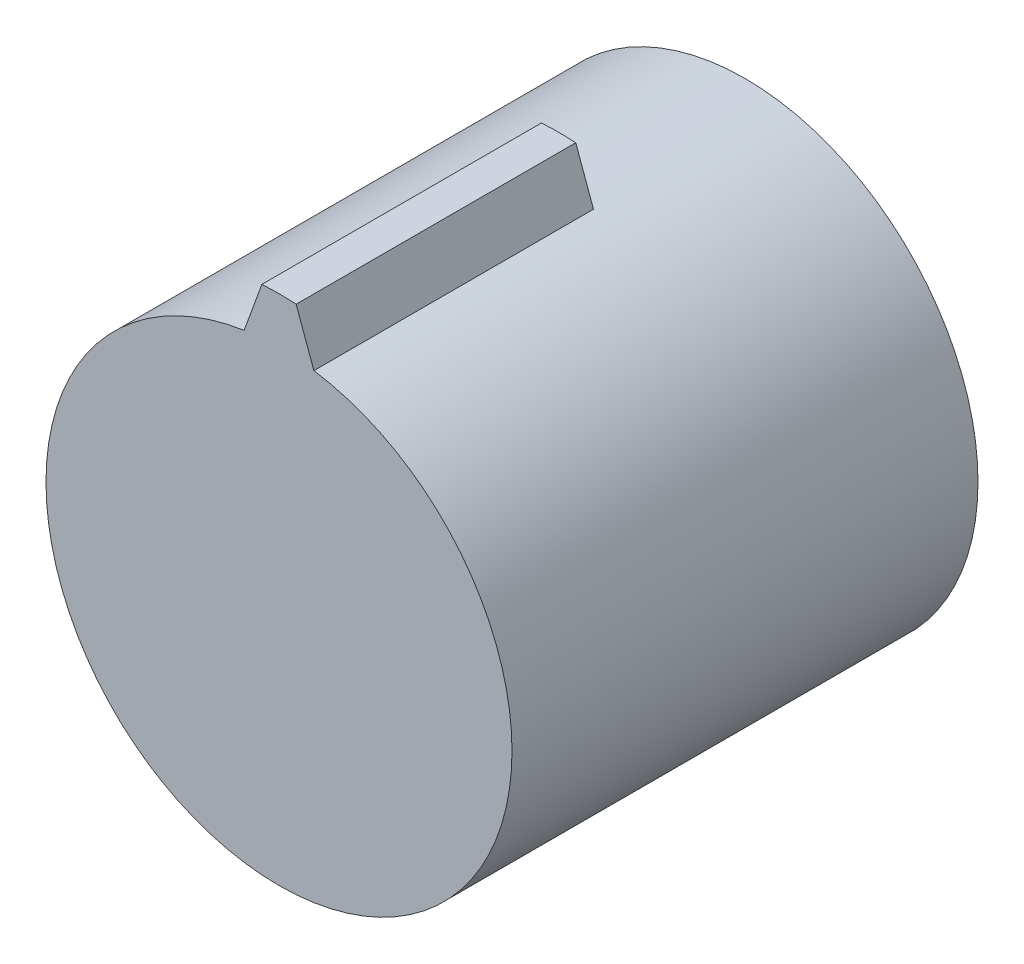
ISO-10303-21;
HEADER;
FILE_DESCRIPTION(('STEP AP214'),'2;1');
FILE_NAME('part.step','',(''),(''),'','','');
FILE_SCHEMA(('AUTOMOTIVE_DESIGN { 1 0 10303 214 1 1 1 1 }'));
ENDSEC;
DATA;
#1=APPLICATION_CONTEXT('core data for automotive mechanical design processes');
#2=APPLICATION_PROTOCOL_DEFINITION('international standard','automotive_design',2000,#1);
#3=PRODUCT_CONTEXT('',#1,'mechanical');
#4=PRODUCT('Part','Part','',(#3));
#5=PRODUCT_RELATED_PRODUCT_CATEGORY('part','',(#4));
#6=PRODUCT_DEFINITION_FORMATION('','',#4);
#7=PRODUCT_DEFINITION_CONTEXT('part definition',#1,'design');
#8=PRODUCT_DEFINITION('design','',#6,#7);
#9=PRODUCT_DEFINITION_SHAPE('','',#8);
#10=(LENGTH_UNIT() NAMED_UNIT(*) SI_UNIT(.MILLI.,.METRE.));
#11=(NAMED_UNIT(*) PLANE_ANGLE_UNIT() SI_UNIT($,.RADIAN.));
#12=(NAMED_UNIT(*) SI_UNIT($,.STERADIAN.) SOLID_ANGLE_UNIT());
#13=UNCERTAINTY_MEASURE_WITH_UNIT(LENGTH_MEASURE(1.E-05),#10,'distance_accuracy_value','');
#14=(GEOMETRIC_REPRESENTATION_CONTEXT(3) GLOBAL_UNCERTAINTY_ASSIGNED_CONTEXT((#13)) GLOBAL_UNIT_ASSIGNED_CONTEXT((#10,
#11,#12)) REPRESENTATION_CONTEXT('',''));
#15=CARTESIAN_POINT('',(0.,0.,0.));
#16=DIRECTION('',(0.,0.,1.));
#17=DIRECTION('',(1.,0.,0.));
#18=AXIS2_PLACEMENT_3D('',#15,#16,#17);
#19=CARTESIAN_POINT('',(0.,0.,5.));
#20=DIRECTION('',(0.,0.,-1.));
#21=DIRECTION('',(-1.,0.,0.));
#22=AXIS2_PLACEMENT_3D('',#19,#20,#21);
#23=CYLINDRICAL_SURFACE('',#22,2.5);
#24=CARTESIAN_POINT('',(0.,0.,5.));
#25=DIRECTION('',(0.,0.,1.));
#26=DIRECTION('',(1.,0.,0.));
#27=AXIS2_PLACEMENT_3D('',#24,#25,#26);
#28=CIRCLE('',#27,2.5);
#29=CARTESIAN_POINT('',(-0.37422223237979,2.47183286667863,5.));
#30=VERTEX_POINT('',#29);
#31=CARTESIAN_POINT('',(0.37422223237979,2.47183286667863,5.));
#32=VERTEX_POINT('',#31);
#33=EDGE_CURVE('E11',#30,#32,#28,.T.);
#34=ORIENTED_EDGE('',*,*,#33,.F.);
#35=DIRECTION('',(0.,0.,1.));
#36=VECTOR('',#35,1.);
#37=CARTESIAN_POINT('',(-0.37422223237979,2.47183286667863,2.));
#38=LINE('',#37,#36);
#39=CARTESIAN_POINT('',(-0.37422223237979,2.47183286667863,2.));
#40=VERTEX_POINT('',#39);
#41=EDGE_CURVE('E103',#40,#30,#38,.T.);
#42=ORIENTED_EDGE('',*,*,#41,.F.);
#43=CARTESIAN_POINT('',(0.,0.,2.));
#44=DIRECTION('',(0.,0.,-1.));
#45=DIRECTION('',(1.,0.,0.));
#46=AXIS2_PLACEMENT_3D('',#43,#44,#45);
#47=CIRCLE('',#46,2.5);
#48=CARTESIAN_POINT('',(0.37422223237979,2.47183286667863,2.));
#49=VERTEX_POINT('',#48);
#50=EDGE_CURVE('E57',#40,#49,#47,.T.);
#51=ORIENTED_EDGE('',*,*,#50,.T.);
#52=DIRECTION('',(0.,0.,1.));
#53=VECTOR('',#52,1.);
#54=CARTESIAN_POINT('',(0.37422223237979,2.47183286667863,2.));
#55=LINE('',#54,#53);
#56=EDGE_CURVE('E81',#49,#32,#55,.T.);
#57=ORIENTED_EDGE('',*,*,#56,.T.);
#58=EDGE_LOOP('',(#34,#42,#51,#57));
#59=FACE_BOUND('',#58,.T.);
#60=CARTESIAN_POINT('',(0.,0.,0.));
#61=DIRECTION('',(0.,0.,1.));
#62=DIRECTION('',(1.,0.,0.));
#63=AXIS2_PLACEMENT_3D('',#60,#61,#62);
#64=CIRCLE('',#63,2.5);
#65=CARTESIAN_POINT('',(2.5,0.,0.));
#66=VERTEX_POINT('',#65);
#67=EDGE_CURVE('E38',#66,#66,#64,.T.);
#68=ORIENTED_EDGE('',*,*,#67,.T.);
#69=EDGE_LOOP('',(#68));
#70=FACE_BOUND('',#69,.T.);
#71=ADVANCED_FACE('F35',(#59,#70),#23,.T.);
#72=CARTESIAN_POINT('',(0.,0.,5.));
#73=DIRECTION('',(0.,0.,1.));
#74=DIRECTION('',(1.,0.,0.));
#75=AXIS2_PLACEMENT_3D('',#72,#73,#74);
#76=PLANE('',#75);
#77=ORIENTED_EDGE('',*,*,#33,.T.);
#78=DIRECTION('',(-0.34202014332567,0.939692620785908,0.));
#79=VECTOR('',#78,1.);
#80=CARTESIAN_POINT('',(0.184041748776157,2.99434945100057,5.));
#81=LINE('',#80,#79);
#82=CARTESIAN_POINT('',(0.184041748776157,2.99434945100057,5.));
#83=VERTEX_POINT('',#82);
#84=EDGE_CURVE('E99',#32,#83,#81,.T.);
#85=ORIENTED_EDGE('',*,*,#84,.T.);
#86=CARTESIAN_POINT('',(0.,0.,5.));
#87=DIRECTION('',(0.,0.,1.));
#88=DIRECTION('',(1.,0.,0.));
#89=AXIS2_PLACEMENT_3D('',#86,#87,#88);
#90=CIRCLE('',#89,3.);
#91=CARTESIAN_POINT('',(-0.184041748776157,2.99434945100057,5.));
#92=VERTEX_POINT('',#91);
#93=EDGE_CURVE('E87',#83,#92,#90,.T.);
#94=ORIENTED_EDGE('',*,*,#93,.T.);
#95=DIRECTION('',(-0.34202014332567,-0.939692620785908,0.));
#96=VECTOR('',#95,1.);
#97=CARTESIAN_POINT('',(-0.184041748776157,2.99434945100057,5.));
#98=LINE('',#97,#96);
#99=EDGE_CURVE('E48',#92,#30,#98,.T.);
#100=ORIENTED_EDGE('',*,*,#99,.T.);
#101=EDGE_LOOP('',(#77,#85,#94,#100));
#102=FACE_BOUND('',#101,.T.);
#103=ADVANCED_FACE('F110',(#102),#76,.T.);
#104=CARTESIAN_POINT('',(0.,0.,0.));
#105=DIRECTION('',(0.,0.,1.));
#106=DIRECTION('',(1.,0.,0.));
#107=AXIS2_PLACEMENT_3D('',#104,#105,#106);
#108=PLANE('',#107);
#109=ORIENTED_EDGE('',*,*,#67,.F.);
#110=EDGE_LOOP('',(#109));
#111=FACE_BOUND('',#110,.T.);
#112=ADVANCED_FACE('F114',(#111),#108,.F.);
#113=CARTESIAN_POINT('',(-0.184041748776157,2.99434945100057,2.));
#114=DIRECTION('',(-0.939692620785908,0.34202014332567,0.));
#115=DIRECTION('',(-0.34202014332567,-0.939692620785908,0.));
#116=AXIS2_PLACEMENT_3D('',#113,#114,#115);
#117=PLANE('',#116);
#118=ORIENTED_EDGE('',*,*,#99,.F.);
#119=DIRECTION('',(0.,0.,1.));
#120=VECTOR('',#119,1.);
#121=CARTESIAN_POINT('',(-0.184041748776157,2.99434945100057,2.));
#122=LINE('',#121,#120);
#123=CARTESIAN_POINT('',(-0.184041748776157,2.99434945100057,2.));
#124=VERTEX_POINT('',#123);
#125=EDGE_CURVE('E75',#124,#92,#122,.T.);
#126=ORIENTED_EDGE('',*,*,#125,.F.);
#127=DIRECTION('',(-0.34202014332567,-0.939692620785908,0.));
#128=VECTOR('',#127,1.);
#129=CARTESIAN_POINT('',(-0.184041748776157,2.99434945100057,2.));
#130=LINE('',#129,#128);
#131=EDGE_CURVE('E92',#124,#40,#130,.T.);
#132=ORIENTED_EDGE('',*,*,#131,.T.);
#133=ORIENTED_EDGE('',*,*,#41,.T.);
#134=EDGE_LOOP('',(#118,#126,#132,#133));
#135=FACE_BOUND('',#134,.T.);
#136=ADVANCED_FACE('F112',(#135),#117,.T.);
#137=CARTESIAN_POINT('',(0.,0.,2.));
#138=DIRECTION('',(0.,0.,1.));
#139=DIRECTION('',(1.,0.,0.));
#140=AXIS2_PLACEMENT_3D('',#137,#138,#139);
#141=CYLINDRICAL_SURFACE('',#140,3.);
#142=ORIENTED_EDGE('',*,*,#93,.F.);
#143=DIRECTION('',(0.,0.,1.));
#144=VECTOR('',#143,1.);
#145=CARTESIAN_POINT('',(0.184041748776157,2.99434945100057,2.));
#146=LINE('',#145,#144);
#147=CARTESIAN_POINT('',(0.184041748776157,2.99434945100057,2.));
#148=VERTEX_POINT('',#147);
#149=EDGE_CURVE('E83',#148,#83,#146,.T.);
#150=ORIENTED_EDGE('',*,*,#149,.F.);
#151=CARTESIAN_POINT('',(0.,0.,2.));
#152=DIRECTION('',(0.,0.,1.));
#153=DIRECTION('',(1.,0.,0.));
#154=AXIS2_PLACEMENT_3D('',#151,#152,#153);
#155=CIRCLE('',#154,3.);
#156=EDGE_CURVE('E86',#148,#124,#155,.T.);
#157=ORIENTED_EDGE('',*,*,#156,.T.);
#158=ORIENTED_EDGE('',*,*,#125,.T.);
#159=EDGE_LOOP('',(#142,#150,#157,#158));
#160=FACE_BOUND('',#159,.T.);
#161=ADVANCED_FACE('F85',(#160),#141,.T.);
#162=CARTESIAN_POINT('',(0.184041748776157,2.99434945100057,2.));
#163=DIRECTION('',(0.939692620785908,0.34202014332567,0.));
#164=DIRECTION('',(-0.34202014332567,0.939692620785908,0.));
#165=AXIS2_PLACEMENT_3D('',#162,#163,#164);
#166=PLANE('',#165);
#167=ORIENTED_EDGE('',*,*,#84,.F.);
#168=ORIENTED_EDGE('',*,*,#56,.F.);
#169=DIRECTION('',(-0.34202014332567,0.939692620785908,0.));
#170=VECTOR('',#169,1.);
#171=CARTESIAN_POINT('',(0.184041748776157,2.99434945100057,2.));
#172=LINE('',#171,#170);
#173=EDGE_CURVE('E91',#49,#148,#172,.T.);
#174=ORIENTED_EDGE('',*,*,#173,.T.);
#175=ORIENTED_EDGE('',*,*,#149,.T.);
#176=EDGE_LOOP('',(#167,#168,#174,#175));
#177=FACE_BOUND('',#176,.T.);
#178=ADVANCED_FACE('F94',(#177),#166,.T.);
#179=CARTESIAN_POINT('',(0.,0.,2.));
#180=DIRECTION('',(0.,0.,1.));
#181=DIRECTION('',(1.,0.,0.));
#182=AXIS2_PLACEMENT_3D('',#179,#180,#181);
#183=PLANE('',#182);
#184=ORIENTED_EDGE('',*,*,#50,.F.);
#185=ORIENTED_EDGE('',*,*,#131,.F.);
#186=ORIENTED_EDGE('',*,*,#156,.F.);
#187=ORIENTED_EDGE('',*,*,#173,.F.);
#188=EDGE_LOOP('',(#184,#185,#186,#187));
#189=FACE_BOUND('',#188,.T.);
#190=ADVANCED_FACE('F90',(#189),#183,.F.);
#191=CLOSED_SHELL('',(#71,#103,#112,#136,#161,#178,#190));
#192=MANIFOLD_SOLID_BREP('B2',#191);
#193=ADVANCED_BREP_SHAPE_REPRESENTATION('',(#18,#192),#14);
#194=SHAPE_DEFINITION_REPRESENTATION(#9,#193);
ENDSEC;
END-ISO-10303-21;
